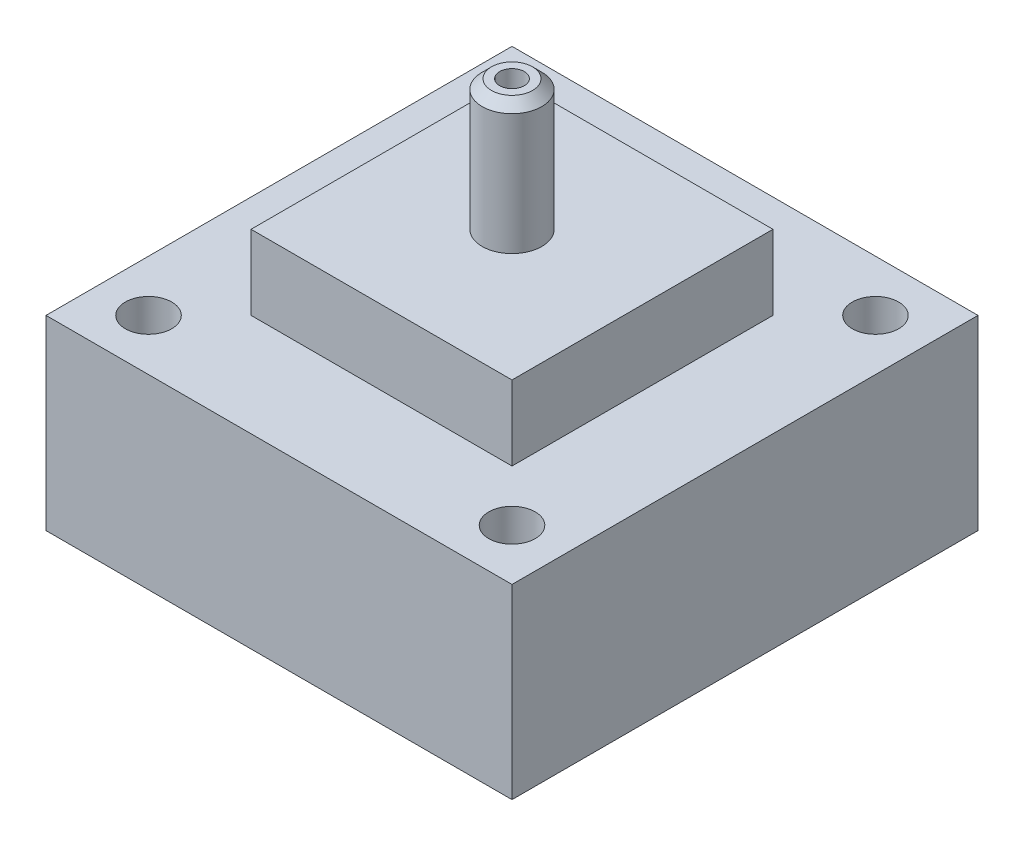
ISO-10303-21;
HEADER;
FILE_DESCRIPTION(('STEP AP214'),'2;1');
FILE_NAME('part.step','',(''),(''),'','','');
FILE_SCHEMA(('AUTOMOTIVE_DESIGN { 1 0 10303 214 1 1 1 1 }'));
ENDSEC;
DATA;
#1=APPLICATION_CONTEXT('core data for automotive mechanical design processes');
#2=APPLICATION_PROTOCOL_DEFINITION('international standard','automotive_design',2000,#1);
#3=PRODUCT_CONTEXT('',#1,'mechanical');
#4=PRODUCT('Part','Part','',(#3));
#5=PRODUCT_RELATED_PRODUCT_CATEGORY('part','',(#4));
#6=PRODUCT_DEFINITION_FORMATION('','',#4);
#7=PRODUCT_DEFINITION_CONTEXT('part definition',#1,'design');
#8=PRODUCT_DEFINITION('design','',#6,#7);
#9=PRODUCT_DEFINITION_SHAPE('','',#8);
#10=(LENGTH_UNIT() NAMED_UNIT(*) SI_UNIT(.MILLI.,.METRE.));
#11=(NAMED_UNIT(*) PLANE_ANGLE_UNIT() SI_UNIT($,.RADIAN.));
#12=(NAMED_UNIT(*) SI_UNIT($,.STERADIAN.) SOLID_ANGLE_UNIT());
#13=UNCERTAINTY_MEASURE_WITH_UNIT(LENGTH_MEASURE(1.E-05),#10,'distance_accuracy_value','');
#14=(GEOMETRIC_REPRESENTATION_CONTEXT(3) GLOBAL_UNCERTAINTY_ASSIGNED_CONTEXT((#13)) GLOBAL_UNIT_ASSIGNED_CONTEXT((#10,
#11,#12)) REPRESENTATION_CONTEXT('',''));
#15=CARTESIAN_POINT('',(0.,0.,0.));
#16=DIRECTION('',(0.,0.,1.));
#17=DIRECTION('',(1.,0.,0.));
#18=AXIS2_PLACEMENT_3D('',#15,#16,#17);
#19=CARTESIAN_POINT('',(-7.,4.,7.));
#20=DIRECTION('',(1.,0.,0.));
#21=DIRECTION('',(0.,0.,-1.));
#22=AXIS2_PLACEMENT_3D('',#19,#20,#21);
#23=PLANE('',#22);
#24=DIRECTION('',(0.,0.,1.));
#25=VECTOR('',#24,1.);
#26=CARTESIAN_POINT('',(-7.,0.,7.));
#27=LINE('',#26,#25);
#28=CARTESIAN_POINT('',(-7.,0.,-7.));
#29=VERTEX_POINT('',#28);
#30=CARTESIAN_POINT('',(-7.,0.,7.));
#31=VERTEX_POINT('',#30);
#32=EDGE_CURVE('E138',#29,#31,#27,.T.);
#33=ORIENTED_EDGE('',*,*,#32,.T.);
#34=DIRECTION('',(0.,-1.,0.));
#35=VECTOR('',#34,1.);
#36=CARTESIAN_POINT('',(-7.,4.,7.));
#37=LINE('',#36,#35);
#38=CARTESIAN_POINT('',(-7.,4.,7.));
#39=VERTEX_POINT('',#38);
#40=EDGE_CURVE('E11',#39,#31,#37,.T.);
#41=ORIENTED_EDGE('',*,*,#40,.F.);
#42=DIRECTION('',(0.,0.,1.));
#43=VECTOR('',#42,1.);
#44=CARTESIAN_POINT('',(-7.,4.,7.));
#45=LINE('',#44,#43);
#46=CARTESIAN_POINT('',(-7.,4.,-7.));
#47=VERTEX_POINT('',#46);
#48=EDGE_CURVE('E151',#47,#39,#45,.T.);
#49=ORIENTED_EDGE('',*,*,#48,.F.);
#50=DIRECTION('',(0.,-1.,0.));
#51=VECTOR('',#50,1.);
#52=CARTESIAN_POINT('',(-7.,4.,-7.));
#53=LINE('',#52,#51);
#54=EDGE_CURVE('E162',#47,#29,#53,.T.);
#55=ORIENTED_EDGE('',*,*,#54,.T.);
#56=EDGE_LOOP('',(#33,#41,#49,#55));
#57=FACE_BOUND('',#56,.T.);
#58=ADVANCED_FACE('F47',(#57),#23,.F.);
#59=CARTESIAN_POINT('',(-7.,4.,7.));
#60=DIRECTION('',(0.,0.,-1.));
#61=DIRECTION('',(-1.,0.,0.));
#62=AXIS2_PLACEMENT_3D('',#59,#60,#61);
#63=PLANE('',#62);
#64=DIRECTION('',(1.,0.,0.));
#65=VECTOR('',#64,1.);
#66=CARTESIAN_POINT('',(-7.,0.,7.));
#67=LINE('',#66,#65);
#68=CARTESIAN_POINT('',(7.,0.,7.));
#69=VERTEX_POINT('',#68);
#70=EDGE_CURVE('E144',#31,#69,#67,.T.);
#71=ORIENTED_EDGE('',*,*,#70,.T.);
#72=DIRECTION('',(0.,-1.,0.));
#73=VECTOR('',#72,1.);
#74=CARTESIAN_POINT('',(7.,4.,7.));
#75=LINE('',#74,#73);
#76=CARTESIAN_POINT('',(7.,4.,7.));
#77=VERTEX_POINT('',#76);
#78=EDGE_CURVE('E57',#77,#69,#75,.T.);
#79=ORIENTED_EDGE('',*,*,#78,.F.);
#80=DIRECTION('',(1.,0.,0.));
#81=VECTOR('',#80,1.);
#82=CARTESIAN_POINT('',(-7.,4.,7.));
#83=LINE('',#82,#81);
#84=EDGE_CURVE('E154',#39,#77,#83,.T.);
#85=ORIENTED_EDGE('',*,*,#84,.F.);
#86=ORIENTED_EDGE('',*,*,#40,.T.);
#87=EDGE_LOOP('',(#71,#79,#85,#86));
#88=FACE_BOUND('',#87,.T.);
#89=ADVANCED_FACE('F192',(#88),#63,.F.);
#90=CARTESIAN_POINT('',(7.,4.,7.));
#91=DIRECTION('',(-1.,0.,0.));
#92=DIRECTION('',(0.,0.,1.));
#93=AXIS2_PLACEMENT_3D('',#90,#91,#92);
#94=PLANE('',#93);
#95=DIRECTION('',(0.,0.,-1.));
#96=VECTOR('',#95,1.);
#97=CARTESIAN_POINT('',(7.,0.,7.));
#98=LINE('',#97,#96);
#99=CARTESIAN_POINT('',(7.,0.,-7.));
#100=VERTEX_POINT('',#99);
#101=EDGE_CURVE('E167',#69,#100,#98,.T.);
#102=ORIENTED_EDGE('',*,*,#101,.T.);
#103=DIRECTION('',(0.,-1.,0.));
#104=VECTOR('',#103,1.);
#105=CARTESIAN_POINT('',(7.,4.,-7.));
#106=LINE('',#105,#104);
#107=CARTESIAN_POINT('',(7.,4.,-7.));
#108=VERTEX_POINT('',#107);
#109=EDGE_CURVE('E177',#108,#100,#106,.T.);
#110=ORIENTED_EDGE('',*,*,#109,.F.);
#111=DIRECTION('',(0.,0.,-1.));
#112=VECTOR('',#111,1.);
#113=CARTESIAN_POINT('',(7.,4.,7.));
#114=LINE('',#113,#112);
#115=EDGE_CURVE('E158',#77,#108,#114,.T.);
#116=ORIENTED_EDGE('',*,*,#115,.F.);
#117=ORIENTED_EDGE('',*,*,#78,.T.);
#118=EDGE_LOOP('',(#102,#110,#116,#117));
#119=FACE_BOUND('',#118,.T.);
#120=ADVANCED_FACE('F188',(#119),#94,.F.);
#121=CARTESIAN_POINT('',(-7.,4.,-7.));
#122=DIRECTION('',(0.,0.,1.));
#123=DIRECTION('',(1.,0.,0.));
#124=AXIS2_PLACEMENT_3D('',#121,#122,#123);
#125=PLANE('',#124);
#126=DIRECTION('',(-1.,0.,0.));
#127=VECTOR('',#126,1.);
#128=CARTESIAN_POINT('',(-7.,0.,-7.));
#129=LINE('',#128,#127);
#130=EDGE_CURVE('E155',#100,#29,#129,.T.);
#131=ORIENTED_EDGE('',*,*,#130,.T.);
#132=ORIENTED_EDGE('',*,*,#54,.F.);
#133=DIRECTION('',(-1.,0.,0.));
#134=VECTOR('',#133,1.);
#135=CARTESIAN_POINT('',(-7.,4.,-7.));
#136=LINE('',#135,#134);
#137=EDGE_CURVE('E64',#108,#47,#136,.T.);
#138=ORIENTED_EDGE('',*,*,#137,.F.);
#139=ORIENTED_EDGE('',*,*,#109,.T.);
#140=EDGE_LOOP('',(#131,#132,#138,#139));
#141=FACE_BOUND('',#140,.T.);
#142=ADVANCED_FACE('F198',(#141),#125,.F.);
#143=CARTESIAN_POINT('',(0.,4.,0.));
#144=DIRECTION('',(0.,-1.,0.));
#145=DIRECTION('',(0.,0.,-1.));
#146=AXIS2_PLACEMENT_3D('',#143,#144,#145);
#147=PLANE('',#146);
#148=CARTESIAN_POINT('',(0.,4.,0.));
#149=DIRECTION('',(0.,-1.,0.));
#150=DIRECTION('',(0.,0.,-1.));
#151=AXIS2_PLACEMENT_3D('',#148,#149,#150);
#152=CIRCLE('',#151,1.6);
#153=CARTESIAN_POINT('',(0.,4.,-1.6));
#154=VERTEX_POINT('',#153);
#155=EDGE_CURVE('E435',#154,#154,#152,.T.);
#156=ORIENTED_EDGE('',*,*,#155,.T.);
#157=EDGE_LOOP('',(#156));
#158=FACE_BOUND('',#157,.T.);
#159=ORIENTED_EDGE('',*,*,#48,.T.);
#160=ORIENTED_EDGE('',*,*,#84,.T.);
#161=ORIENTED_EDGE('',*,*,#115,.T.);
#162=ORIENTED_EDGE('',*,*,#137,.T.);
#163=EDGE_LOOP('',(#159,#160,#161,#162));
#164=FACE_BOUND('',#163,.T.);
#165=ADVANCED_FACE('F201',(#158,#164),#147,.F.);
#166=CARTESIAN_POINT('',(0.,-10.,0.));
#167=DIRECTION('',(0.,-1.,0.));
#168=DIRECTION('',(0.,0.,-1.));
#169=AXIS2_PLACEMENT_3D('',#166,#167,#168);
#170=PLANE('',#169);
#171=CARTESIAN_POINT('',(0.,-10.,0.));
#172=DIRECTION('',(0.,-1.,0.));
#173=DIRECTION('',(0.,0.,-1.));
#174=AXIS2_PLACEMENT_3D('',#171,#172,#173);
#175=CIRCLE('',#174,4.23);
#176=CARTESIAN_POINT('',(0.,-10.,-4.23));
#177=VERTEX_POINT('',#176);
#178=EDGE_CURVE('E441',#177,#177,#175,.T.);
#179=ORIENTED_EDGE('',*,*,#178,.F.);
#180=EDGE_LOOP('',(#179));
#181=FACE_BOUND('',#180,.T.);
#182=CARTESIAN_POINT('',(9.74999999999993,-10.,-9.75000000000006));
#183=DIRECTION('',(0.,-1.,0.));
#184=DIRECTION('',(0.,0.,-1.));
#185=AXIS2_PLACEMENT_3D('',#182,#183,#184);
#186=CIRCLE('',#185,1.2446);
#187=CARTESIAN_POINT('',(9.74999999999993,-10.,-10.9946000000001));
#188=VERTEX_POINT('',#187);
#189=EDGE_CURVE('E456',#188,#188,#186,.T.);
#190=ORIENTED_EDGE('',*,*,#189,.F.);
#191=EDGE_LOOP('',(#190));
#192=FACE_BOUND('',#191,.T.);
#193=CARTESIAN_POINT('',(-9.75,-10.,9.75));
#194=DIRECTION('',(0.,-1.,0.));
#195=DIRECTION('',(0.,0.,-1.));
#196=AXIS2_PLACEMENT_3D('',#193,#194,#195);
#197=CIRCLE('',#196,1.2446);
#198=CARTESIAN_POINT('',(-9.75,-10.,8.5054));
#199=VERTEX_POINT('',#198);
#200=EDGE_CURVE('E472',#199,#199,#197,.T.);
#201=ORIENTED_EDGE('',*,*,#200,.F.);
#202=EDGE_LOOP('',(#201));
#203=FACE_BOUND('',#202,.T.);
#204=DIRECTION('',(1.,0.,0.));
#205=VECTOR('',#204,1.);
#206=CARTESIAN_POINT('',(-12.5,-10.,-12.5));
#207=LINE('',#206,#205);
#208=CARTESIAN_POINT('',(-12.5,-10.,-12.5));
#209=VERTEX_POINT('',#208);
#210=CARTESIAN_POINT('',(12.5,-10.,-12.5));
#211=VERTEX_POINT('',#210);
#212=EDGE_CURVE('E121',#209,#211,#207,.T.);
#213=ORIENTED_EDGE('',*,*,#212,.T.);
#214=DIRECTION('',(0.,0.,1.));
#215=VECTOR('',#214,1.);
#216=CARTESIAN_POINT('',(12.5,-10.,-12.5));
#217=LINE('',#216,#215);
#218=CARTESIAN_POINT('',(12.5,-10.,12.5));
#219=VERTEX_POINT('',#218);
#220=EDGE_CURVE('E109',#211,#219,#217,.T.);
#221=ORIENTED_EDGE('',*,*,#220,.T.);
#222=DIRECTION('',(-1.,0.,0.));
#223=VECTOR('',#222,1.);
#224=CARTESIAN_POINT('',(-12.5,-10.,12.5));
#225=LINE('',#224,#223);
#226=CARTESIAN_POINT('',(-12.5,-10.,12.5));
#227=VERTEX_POINT('',#226);
#228=EDGE_CURVE('E120',#219,#227,#225,.T.);
#229=ORIENTED_EDGE('',*,*,#228,.T.);
#230=DIRECTION('',(0.,0.,-1.));
#231=VECTOR('',#230,1.);
#232=CARTESIAN_POINT('',(-12.5,-10.,-12.5));
#233=LINE('',#232,#231);
#234=EDGE_CURVE('E127',#227,#209,#233,.T.);
#235=ORIENTED_EDGE('',*,*,#234,.T.);
#236=EDGE_LOOP('',(#213,#221,#229,#235));
#237=FACE_BOUND('',#236,.T.);
#238=CARTESIAN_POINT('',(9.75000000000004,-10.,9.74999999999996));
#239=DIRECTION('',(0.,-1.,0.));
#240=DIRECTION('',(0.,0.,-1.));
#241=AXIS2_PLACEMENT_3D('',#238,#239,#240);
#242=CIRCLE('',#241,1.2446);
#243=CARTESIAN_POINT('',(9.75000000000004,-10.,8.50539999999996));
#244=VERTEX_POINT('',#243);
#245=EDGE_CURVE('E464',#244,#244,#242,.T.);
#246=ORIENTED_EDGE('',*,*,#245,.F.);
#247=EDGE_LOOP('',(#246));
#248=FACE_BOUND('',#247,.T.);
#249=CARTESIAN_POINT('',(-9.7500000000001,-10.,-9.7499999999999));
#250=DIRECTION('',(0.,-1.,0.));
#251=DIRECTION('',(0.,0.,-1.));
#252=AXIS2_PLACEMENT_3D('',#249,#250,#251);
#253=CIRCLE('',#252,1.2446);
#254=CARTESIAN_POINT('',(-9.7500000000001,-10.,-10.9945999999999));
#255=VERTEX_POINT('',#254);
#256=EDGE_CURVE('E449',#255,#255,#253,.T.);
#257=ORIENTED_EDGE('',*,*,#256,.F.);
#258=EDGE_LOOP('',(#257));
#259=FACE_BOUND('',#258,.T.);
#260=ADVANCED_FACE('F124',(#181,#192,#203,#237,#248,#259),#170,.T.);
#261=CARTESIAN_POINT('',(0.,0.,0.));
#262=DIRECTION('',(0.,-1.,0.));
#263=DIRECTION('',(0.,0.,-1.));
#264=AXIS2_PLACEMENT_3D('',#261,#262,#263);
#265=PLANE('',#264);
#266=ORIENTED_EDGE('',*,*,#32,.F.);
#267=ORIENTED_EDGE('',*,*,#130,.F.);
#268=ORIENTED_EDGE('',*,*,#101,.F.);
#269=ORIENTED_EDGE('',*,*,#70,.F.);
#270=EDGE_LOOP('',(#266,#267,#268,#269));
#271=FACE_BOUND('',#270,.T.);
#272=DIRECTION('',(1.,0.,0.));
#273=VECTOR('',#272,1.);
#274=CARTESIAN_POINT('',(-12.5,0.,-12.5));
#275=LINE('',#274,#273);
#276=CARTESIAN_POINT('',(-12.5,0.,-12.5));
#277=VERTEX_POINT('',#276);
#278=CARTESIAN_POINT('',(12.5,0.,-12.5));
#279=VERTEX_POINT('',#278);
#280=EDGE_CURVE('E136',#277,#279,#275,.T.);
#281=ORIENTED_EDGE('',*,*,#280,.F.);
#282=DIRECTION('',(0.,0.,-1.));
#283=VECTOR('',#282,1.);
#284=CARTESIAN_POINT('',(-12.5,0.,-12.5));
#285=LINE('',#284,#283);
#286=CARTESIAN_POINT('',(-12.5,0.,12.5));
#287=VERTEX_POINT('',#286);
#288=EDGE_CURVE('E132',#287,#277,#285,.T.);
#289=ORIENTED_EDGE('',*,*,#288,.F.);
#290=DIRECTION('',(-1.,0.,0.));
#291=VECTOR('',#290,1.);
#292=CARTESIAN_POINT('',(-12.5,0.,12.5));
#293=LINE('',#292,#291);
#294=CARTESIAN_POINT('',(12.5,0.,12.5));
#295=VERTEX_POINT('',#294);
#296=EDGE_CURVE('E487',#295,#287,#293,.T.);
#297=ORIENTED_EDGE('',*,*,#296,.F.);
#298=DIRECTION('',(0.,0.,1.));
#299=VECTOR('',#298,1.);
#300=CARTESIAN_POINT('',(12.5,0.,-12.5));
#301=LINE('',#300,#299);
#302=EDGE_CURVE('E485',#279,#295,#301,.T.);
#303=ORIENTED_EDGE('',*,*,#302,.F.);
#304=EDGE_LOOP('',(#281,#289,#297,#303));
#305=FACE_BOUND('',#304,.T.);
#306=CARTESIAN_POINT('',(-9.75,0.,9.75));
#307=DIRECTION('',(0.,-1.,0.));
#308=DIRECTION('',(0.,0.,-1.));
#309=AXIS2_PLACEMENT_3D('',#306,#307,#308);
#310=CIRCLE('',#309,1.2446);
#311=CARTESIAN_POINT('',(-9.75,0.,8.5054));
#312=VERTEX_POINT('',#311);
#313=EDGE_CURVE('E468',#312,#312,#310,.T.);
#314=ORIENTED_EDGE('',*,*,#313,.T.);
#315=EDGE_LOOP('',(#314));
#316=FACE_BOUND('',#315,.T.);
#317=CARTESIAN_POINT('',(9.75000000000004,0.,9.74999999999996));
#318=DIRECTION('',(0.,-1.,0.));
#319=DIRECTION('',(0.,0.,-1.));
#320=AXIS2_PLACEMENT_3D('',#317,#318,#319);
#321=CIRCLE('',#320,1.2446);
#322=CARTESIAN_POINT('',(9.75000000000004,0.,8.50539999999996));
#323=VERTEX_POINT('',#322);
#324=EDGE_CURVE('E460',#323,#323,#321,.T.);
#325=ORIENTED_EDGE('',*,*,#324,.T.);
#326=EDGE_LOOP('',(#325));
#327=FACE_BOUND('',#326,.T.);
#328=CARTESIAN_POINT('',(9.74999999999993,0.,-9.75000000000006));
#329=DIRECTION('',(0.,-1.,0.));
#330=DIRECTION('',(0.,0.,-1.));
#331=AXIS2_PLACEMENT_3D('',#328,#329,#330);
#332=CIRCLE('',#331,1.2446);
#333=CARTESIAN_POINT('',(9.74999999999993,0.,-10.9946000000001));
#334=VERTEX_POINT('',#333);
#335=EDGE_CURVE('E452',#334,#334,#332,.T.);
#336=ORIENTED_EDGE('',*,*,#335,.T.);
#337=EDGE_LOOP('',(#336));
#338=FACE_BOUND('',#337,.T.);
#339=CARTESIAN_POINT('',(-9.7500000000001,0.,-9.7499999999999));
#340=DIRECTION('',(0.,-1.,0.));
#341=DIRECTION('',(0.,0.,-1.));
#342=AXIS2_PLACEMENT_3D('',#339,#340,#341);
#343=CIRCLE('',#342,1.2446);
#344=CARTESIAN_POINT('',(-9.7500000000001,0.,-10.9945999999999));
#345=VERTEX_POINT('',#344);
#346=EDGE_CURVE('E446',#345,#345,#343,.T.);
#347=ORIENTED_EDGE('',*,*,#346,.T.);
#348=EDGE_LOOP('',(#347));
#349=FACE_BOUND('',#348,.T.);
#350=ADVANCED_FACE('F195',(#271,#305,#316,#327,#338,#349),#265,.F.);
#351=CARTESIAN_POINT('',(-12.5,-10.,-12.5));
#352=DIRECTION('',(0.,0.,1.));
#353=DIRECTION('',(1.,0.,0.));
#354=AXIS2_PLACEMENT_3D('',#351,#352,#353);
#355=PLANE('',#354);
#356=ORIENTED_EDGE('',*,*,#280,.T.);
#357=DIRECTION('',(0.,1.,0.));
#358=VECTOR('',#357,1.);
#359=CARTESIAN_POINT('',(12.5,-10.,-12.5));
#360=LINE('',#359,#358);
#361=EDGE_CURVE('E113',#211,#279,#360,.T.);
#362=ORIENTED_EDGE('',*,*,#361,.F.);
#363=ORIENTED_EDGE('',*,*,#212,.F.);
#364=DIRECTION('',(0.,1.,0.));
#365=VECTOR('',#364,1.);
#366=CARTESIAN_POINT('',(-12.5,-10.,-12.5));
#367=LINE('',#366,#365);
#368=EDGE_CURVE('E482',#209,#277,#367,.T.);
#369=ORIENTED_EDGE('',*,*,#368,.T.);
#370=EDGE_LOOP('',(#356,#362,#363,#369));
#371=FACE_BOUND('',#370,.T.);
#372=ADVANCED_FACE('F134',(#371),#355,.F.);
#373=CARTESIAN_POINT('',(12.5,-10.,-12.5));
#374=DIRECTION('',(-1.,0.,0.));
#375=DIRECTION('',(0.,0.,1.));
#376=AXIS2_PLACEMENT_3D('',#373,#374,#375);
#377=PLANE('',#376);
#378=ORIENTED_EDGE('',*,*,#302,.T.);
#379=DIRECTION('',(0.,1.,0.));
#380=VECTOR('',#379,1.);
#381=CARTESIAN_POINT('',(12.5,-10.,12.5));
#382=LINE('',#381,#380);
#383=EDGE_CURVE('E116',#219,#295,#382,.T.);
#384=ORIENTED_EDGE('',*,*,#383,.F.);
#385=ORIENTED_EDGE('',*,*,#220,.F.);
#386=ORIENTED_EDGE('',*,*,#361,.T.);
#387=EDGE_LOOP('',(#378,#384,#385,#386));
#388=FACE_BOUND('',#387,.T.);
#389=ADVANCED_FACE('F111',(#388),#377,.F.);
#390=CARTESIAN_POINT('',(-12.5,-10.,12.5));
#391=DIRECTION('',(0.,0.,-1.));
#392=DIRECTION('',(-1.,0.,0.));
#393=AXIS2_PLACEMENT_3D('',#390,#391,#392);
#394=PLANE('',#393);
#395=ORIENTED_EDGE('',*,*,#296,.T.);
#396=DIRECTION('',(0.,1.,0.));
#397=VECTOR('',#396,1.);
#398=CARTESIAN_POINT('',(-12.5,-10.,12.5));
#399=LINE('',#398,#397);
#400=EDGE_CURVE('E147',#227,#287,#399,.T.);
#401=ORIENTED_EDGE('',*,*,#400,.F.);
#402=ORIENTED_EDGE('',*,*,#228,.F.);
#403=ORIENTED_EDGE('',*,*,#383,.T.);
#404=EDGE_LOOP('',(#395,#401,#402,#403));
#405=FACE_BOUND('',#404,.T.);
#406=ADVANCED_FACE('F250',(#405),#394,.F.);
#407=CARTESIAN_POINT('',(-12.5,-10.,-12.5));
#408=DIRECTION('',(1.,0.,0.));
#409=DIRECTION('',(0.,0.,-1.));
#410=AXIS2_PLACEMENT_3D('',#407,#408,#409);
#411=PLANE('',#410);
#412=ORIENTED_EDGE('',*,*,#288,.T.);
#413=ORIENTED_EDGE('',*,*,#368,.F.);
#414=ORIENTED_EDGE('',*,*,#234,.F.);
#415=ORIENTED_EDGE('',*,*,#400,.T.);
#416=EDGE_LOOP('',(#412,#413,#414,#415));
#417=FACE_BOUND('',#416,.T.);
#418=ADVANCED_FACE('F259',(#417),#411,.F.);
#419=CARTESIAN_POINT('',(-9.75,-10.,9.75));
#420=DIRECTION('',(0.,1.,0.));
#421=DIRECTION('',(0.,0.,1.));
#422=AXIS2_PLACEMENT_3D('',#419,#420,#421);
#423=CYLINDRICAL_SURFACE('',#422,1.2446);
#424=ORIENTED_EDGE('',*,*,#200,.T.);
#425=EDGE_LOOP('',(#424));
#426=FACE_BOUND('',#425,.T.);
#427=ORIENTED_EDGE('',*,*,#313,.F.);
#428=EDGE_LOOP('',(#427));
#429=FACE_BOUND('',#428,.T.);
#430=ADVANCED_FACE('F269',(#426,#429),#423,.F.);
#431=CARTESIAN_POINT('',(9.75000000000004,-10.,9.74999999999996));
#432=DIRECTION('',(0.,1.,0.));
#433=DIRECTION('',(0.,0.,1.));
#434=AXIS2_PLACEMENT_3D('',#431,#432,#433);
#435=CYLINDRICAL_SURFACE('',#434,1.2446);
#436=ORIENTED_EDGE('',*,*,#245,.T.);
#437=EDGE_LOOP('',(#436));
#438=FACE_BOUND('',#437,.T.);
#439=ORIENTED_EDGE('',*,*,#324,.F.);
#440=EDGE_LOOP('',(#439));
#441=FACE_BOUND('',#440,.T.);
#442=ADVANCED_FACE('F279',(#438,#441),#435,.F.);
#443=CARTESIAN_POINT('',(9.74999999999993,-10.,-9.75000000000006));
#444=DIRECTION('',(0.,1.,0.));
#445=DIRECTION('',(0.,0.,1.));
#446=AXIS2_PLACEMENT_3D('',#443,#444,#445);
#447=CYLINDRICAL_SURFACE('',#446,1.2446);
#448=ORIENTED_EDGE('',*,*,#189,.T.);
#449=EDGE_LOOP('',(#448));
#450=FACE_BOUND('',#449,.T.);
#451=ORIENTED_EDGE('',*,*,#335,.F.);
#452=EDGE_LOOP('',(#451));
#453=FACE_BOUND('',#452,.T.);
#454=ADVANCED_FACE('F289',(#450,#453),#447,.F.);
#455=CARTESIAN_POINT('',(-9.7500000000001,-10.,-9.7499999999999));
#456=DIRECTION('',(0.,1.,0.));
#457=DIRECTION('',(0.,0.,1.));
#458=AXIS2_PLACEMENT_3D('',#455,#456,#457);
#459=CYLINDRICAL_SURFACE('',#458,1.2446);
#460=ORIENTED_EDGE('',*,*,#256,.T.);
#461=EDGE_LOOP('',(#460));
#462=FACE_BOUND('',#461,.T.);
#463=ORIENTED_EDGE('',*,*,#346,.F.);
#464=EDGE_LOOP('',(#463));
#465=FACE_BOUND('',#464,.T.);
#466=ADVANCED_FACE('F299',(#462,#465),#459,.F.);
#467=CARTESIAN_POINT('',(0.,-0.199999999999999,0.));
#468=DIRECTION('',(0.,-1.,0.));
#469=DIRECTION('',(0.,0.,-1.));
#470=AXIS2_PLACEMENT_3D('',#467,#468,#469);
#471=CYLINDRICAL_SURFACE('',#470,4.23);
#472=CARTESIAN_POINT('',(0.,-0.199999999999999,0.));
#473=DIRECTION('',(0.,-1.,0.));
#474=DIRECTION('',(0.,0.,-1.));
#475=AXIS2_PLACEMENT_3D('',#472,#473,#474);
#476=CIRCLE('',#475,4.23);
#477=CARTESIAN_POINT('',(0.,-0.199999999999999,-4.23));
#478=VERTEX_POINT('',#477);
#479=EDGE_CURVE('E442',#478,#478,#476,.T.);
#480=ORIENTED_EDGE('',*,*,#479,.F.);
#481=EDGE_LOOP('',(#480));
#482=FACE_BOUND('',#481,.T.);
#483=ORIENTED_EDGE('',*,*,#178,.T.);
#484=EDGE_LOOP('',(#483));
#485=FACE_BOUND('',#484,.T.);
#486=ADVANCED_FACE('F309',(#482,#485),#471,.F.);
#487=CARTESIAN_POINT('',(0.,-0.199999999999999,0.));
#488=DIRECTION('',(0.,-1.,0.));
#489=DIRECTION('',(0.,0.,-1.));
#490=AXIS2_PLACEMENT_3D('',#487,#488,#489);
#491=PLANE('',#490);
#492=CARTESIAN_POINT('',(0.,-0.199999999999999,0.));
#493=DIRECTION('',(0.,-1.,0.));
#494=DIRECTION('',(0.,0.,-1.));
#495=AXIS2_PLACEMENT_3D('',#492,#493,#494);
#496=CIRCLE('',#495,0.660399999999999);
#497=CARTESIAN_POINT('',(0.,-0.199999999999999,-0.660399999999999));
#498=VERTEX_POINT('',#497);
#499=EDGE_CURVE('E50',#498,#498,#496,.T.);
#500=ORIENTED_EDGE('',*,*,#499,.F.);
#501=EDGE_LOOP('',(#500));
#502=FACE_BOUND('',#501,.T.);
#503=ORIENTED_EDGE('',*,*,#479,.T.);
#504=EDGE_LOOP('',(#503));
#505=FACE_BOUND('',#504,.T.);
#506=ADVANCED_FACE('F323',(#502,#505),#491,.T.);
#507=CARTESIAN_POINT('',(0.,11.,-1.1));
#508=DIRECTION('',(0.,1.,0.));
#509=DIRECTION('',(0.,0.,1.));
#510=AXIS2_PLACEMENT_3D('',#507,#508,#509);
#511=PLANE('',#510);
#512=CARTESIAN_POINT('',(0.,11.,0.));
#513=DIRECTION('',(0.,-1.,0.));
#514=DIRECTION('',(0.,0.,-1.));
#515=AXIS2_PLACEMENT_3D('',#512,#513,#514);
#516=CIRCLE('',#515,0.6604);
#517=CARTESIAN_POINT('',(0.,11.,-0.6604));
#518=VERTEX_POINT('',#517);
#519=EDGE_CURVE('E422',#518,#518,#516,.T.);
#520=ORIENTED_EDGE('',*,*,#519,.T.);
#521=EDGE_LOOP('',(#520));
#522=FACE_BOUND('',#521,.T.);
#523=CARTESIAN_POINT('',(0.,11.,0.));
#524=DIRECTION('',(0.,-1.,0.));
#525=DIRECTION('',(0.,0.,-1.));
#526=AXIS2_PLACEMENT_3D('',#523,#524,#525);
#527=CIRCLE('',#526,1.1);
#528=CARTESIAN_POINT('',(0.,11.,-1.1));
#529=VERTEX_POINT('',#528);
#530=EDGE_CURVE('E425',#529,#529,#527,.T.);
#531=ORIENTED_EDGE('',*,*,#530,.F.);
#532=EDGE_LOOP('',(#531));
#533=FACE_BOUND('',#532,.T.);
#534=ADVANCED_FACE('F336',(#522,#533),#511,.T.);
#535=CARTESIAN_POINT('',(0.,4.,0.));
#536=DIRECTION('',(0.,-1.,0.));
#537=DIRECTION('',(0.,0.,-1.));
#538=AXIS2_PLACEMENT_3D('',#535,#536,#537);
#539=CYLINDRICAL_SURFACE('',#538,0.660400000000001);
#540=ORIENTED_EDGE('',*,*,#519,.F.);
#541=EDGE_LOOP('',(#540));
#542=FACE_BOUND('',#541,.T.);
#543=ORIENTED_EDGE('',*,*,#499,.T.);
#544=EDGE_LOOP('',(#543));
#545=FACE_BOUND('',#544,.T.);
#546=ADVANCED_FACE('F341',(#542,#545),#539,.F.);
#547=CARTESIAN_POINT('',(0.,4.,0.));
#548=DIRECTION('',(0.,-1.,0.));
#549=DIRECTION('',(0.,0.,-1.));
#550=AXIS2_PLACEMENT_3D('',#547,#548,#549);
#551=CYLINDRICAL_SURFACE('',#550,1.6);
#552=CARTESIAN_POINT('',(0.,10.5,0.));
#553=DIRECTION('',(0.,-1.,0.));
#554=DIRECTION('',(0.,0.,-1.));
#555=AXIS2_PLACEMENT_3D('',#552,#553,#554);
#556=CIRCLE('',#555,1.6);
#557=CARTESIAN_POINT('',(0.,10.5,-1.6));
#558=VERTEX_POINT('',#557);
#559=EDGE_CURVE('E429',#558,#558,#556,.T.);
#560=ORIENTED_EDGE('',*,*,#559,.T.);
#561=EDGE_LOOP('',(#560));
#562=FACE_BOUND('',#561,.T.);
#563=ORIENTED_EDGE('',*,*,#155,.F.);
#564=EDGE_LOOP('',(#563));
#565=FACE_BOUND('',#564,.T.);
#566=ADVANCED_FACE('F349',(#562,#565),#551,.T.);
#567=CARTESIAN_POINT('',(0.,10.5,0.));
#568=DIRECTION('',(0.,-1.,0.));
#569=DIRECTION('',(0.,0.,-1.));
#570=AXIS2_PLACEMENT_3D('',#567,#568,#569);
#571=CONICAL_SURFACE('',#570,1.6,0.785398163397444);
#572=ORIENTED_EDGE('',*,*,#530,.T.);
#573=EDGE_LOOP('',(#572));
#574=FACE_BOUND('',#573,.T.);
#575=ORIENTED_EDGE('',*,*,#559,.F.);
#576=EDGE_LOOP('',(#575));
#577=FACE_BOUND('',#576,.T.);
#578=ADVANCED_FACE('F354',(#574,#577),#571,.T.);
#579=CLOSED_SHELL('',(#58,#89,#120,#142,#165,#260,#350,#372,#389,#406,#418,#430,#442,#454,#466,
#486,#506,#534,#546,#566,#578));
#580=MANIFOLD_SOLID_BREP('B2',#579);
#581=ADVANCED_BREP_SHAPE_REPRESENTATION('',(#18,#580),#14);
#582=SHAPE_DEFINITION_REPRESENTATION(#9,#581);
ENDSEC;
END-ISO-10303-21;
